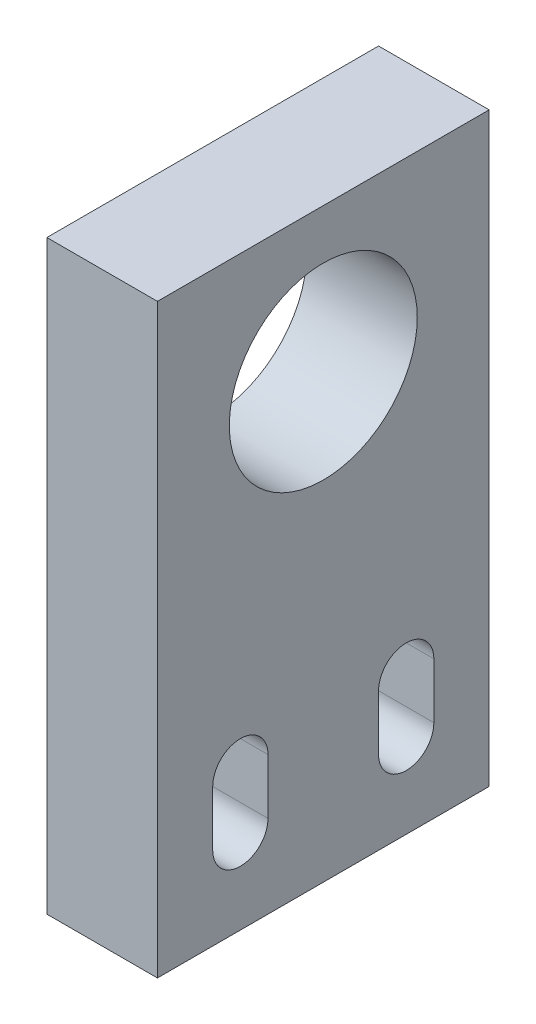
ISO-10303-21;
HEADER;
FILE_DESCRIPTION(('STEP AP214'),'2;1');
FILE_NAME('part.step','',(''),(''),'','','');
FILE_SCHEMA(('AUTOMOTIVE_DESIGN { 1 0 10303 214 1 1 1 1 }'));
ENDSEC;
DATA;
#1=APPLICATION_CONTEXT('core data for automotive mechanical design processes');
#2=APPLICATION_PROTOCOL_DEFINITION('international standard','automotive_design',2000,#1);
#3=PRODUCT_CONTEXT('',#1,'mechanical');
#4=PRODUCT('Part','Part','',(#3));
#5=PRODUCT_RELATED_PRODUCT_CATEGORY('part','',(#4));
#6=PRODUCT_DEFINITION_FORMATION('','',#4);
#7=PRODUCT_DEFINITION_CONTEXT('part definition',#1,'design');
#8=PRODUCT_DEFINITION('design','',#6,#7);
#9=PRODUCT_DEFINITION_SHAPE('','',#8);
#10=(LENGTH_UNIT() NAMED_UNIT(*) SI_UNIT(.MILLI.,.METRE.));
#11=(NAMED_UNIT(*) PLANE_ANGLE_UNIT() SI_UNIT($,.RADIAN.));
#12=(NAMED_UNIT(*) SI_UNIT($,.STERADIAN.) SOLID_ANGLE_UNIT());
#13=UNCERTAINTY_MEASURE_WITH_UNIT(LENGTH_MEASURE(1.E-05),#10,'distance_accuracy_value','');
#14=(GEOMETRIC_REPRESENTATION_CONTEXT(3) GLOBAL_UNCERTAINTY_ASSIGNED_CONTEXT((#13)) GLOBAL_UNIT_ASSIGNED_CONTEXT((#10,
#11,#12)) REPRESENTATION_CONTEXT('',''));
#15=CARTESIAN_POINT('',(0.,0.,0.));
#16=DIRECTION('',(0.,0.,1.));
#17=DIRECTION('',(1.,0.,0.));
#18=AXIS2_PLACEMENT_3D('',#15,#16,#17);
#19=CARTESIAN_POINT('',(10.,0.,0.));
#20=DIRECTION('',(-1.,0.,0.));
#21=DIRECTION('',(0.,0.,1.));
#22=AXIS2_PLACEMENT_3D('',#19,#20,#21);
#23=PLANE('',#22);
#24=CARTESIAN_POINT('',(10.,-27.5,7.49999999999999));
#25=DIRECTION('',(1.,0.,0.));
#26=DIRECTION('',(0.,0.,-1.));
#27=AXIS2_PLACEMENT_3D('',#24,#25,#26);
#28=CIRCLE('',#27,2.50000000000001);
#29=CARTESIAN_POINT('',(10.,-27.5,4.99999999999997));
#30=VERTEX_POINT('',#29);
#31=CARTESIAN_POINT('',(10.,-27.5,9.99999999999999));
#32=VERTEX_POINT('',#31);
#33=EDGE_CURVE('E159',#30,#32,#28,.T.);
#34=ORIENTED_EDGE('',*,*,#33,.F.);
#35=DIRECTION('',(0.,1.,0.));
#36=VECTOR('',#35,1.);
#37=CARTESIAN_POINT('',(10.,-27.5,4.99999999999997));
#38=LINE('',#37,#36);
#39=CARTESIAN_POINT('',(10.,-32.5,4.99999999999997));
#40=VERTEX_POINT('',#39);
#41=EDGE_CURVE('E167',#40,#30,#38,.T.);
#42=ORIENTED_EDGE('',*,*,#41,.F.);
#43=CARTESIAN_POINT('',(10.,-32.5,7.49999999999999));
#44=DIRECTION('',(1.,0.,0.));
#45=DIRECTION('',(0.,0.,-1.));
#46=AXIS2_PLACEMENT_3D('',#43,#44,#45);
#47=CIRCLE('',#46,2.50000000000001);
#48=CARTESIAN_POINT('',(10.,-32.5,10.));
#49=VERTEX_POINT('',#48);
#50=EDGE_CURVE('E164',#49,#40,#47,.T.);
#51=ORIENTED_EDGE('',*,*,#50,.F.);
#52=DIRECTION('',(0.,-1.,0.));
#53=VECTOR('',#52,1.);
#54=CARTESIAN_POINT('',(10.,-27.5,9.99999999999999));
#55=LINE('',#54,#53);
#56=EDGE_CURVE('E161',#32,#49,#55,.T.);
#57=ORIENTED_EDGE('',*,*,#56,.F.);
#58=EDGE_LOOP('',(#34,#42,#51,#57));
#59=FACE_BOUND('',#58,.T.);
#60=DIRECTION('',(0.,-1.,0.));
#61=VECTOR('',#60,1.);
#62=CARTESIAN_POINT('',(10.,-40.,15.));
#63=LINE('',#62,#61);
#64=CARTESIAN_POINT('',(10.,13.,15.));
#65=VERTEX_POINT('',#64);
#66=CARTESIAN_POINT('',(10.,-40.,15.));
#67=VERTEX_POINT('',#66);
#68=EDGE_CURVE('E196',#65,#67,#63,.T.);
#69=ORIENTED_EDGE('',*,*,#68,.T.);
#70=DIRECTION('',(0.,0.,-1.));
#71=VECTOR('',#70,1.);
#72=CARTESIAN_POINT('',(10.,-40.,-15.));
#73=LINE('',#72,#71);
#74=CARTESIAN_POINT('',(10.,-40.,-15.));
#75=VERTEX_POINT('',#74);
#76=EDGE_CURVE('E199',#67,#75,#73,.T.);
#77=ORIENTED_EDGE('',*,*,#76,.T.);
#78=DIRECTION('',(0.,1.,0.));
#79=VECTOR('',#78,1.);
#80=CARTESIAN_POINT('',(10.,13.,-15.));
#81=LINE('',#80,#79);
#82=CARTESIAN_POINT('',(10.,13.,-15.));
#83=VERTEX_POINT('',#82);
#84=EDGE_CURVE('E202',#75,#83,#81,.T.);
#85=ORIENTED_EDGE('',*,*,#84,.T.);
#86=DIRECTION('',(0.,0.,1.));
#87=VECTOR('',#86,1.);
#88=CARTESIAN_POINT('',(10.,13.,15.));
#89=LINE('',#88,#87);
#90=EDGE_CURVE('E204',#83,#65,#89,.T.);
#91=ORIENTED_EDGE('',*,*,#90,.T.);
#92=EDGE_LOOP('',(#69,#77,#85,#91));
#93=FACE_BOUND('',#92,.T.);
#94=CARTESIAN_POINT('',(10.,0.,0.));
#95=DIRECTION('',(1.,0.,0.));
#96=DIRECTION('',(0.,0.,-1.));
#97=AXIS2_PLACEMENT_3D('',#94,#95,#96);
#98=CIRCLE('',#97,8.5);
#99=CARTESIAN_POINT('',(10.,0.,-8.5));
#100=VERTEX_POINT('',#99);
#101=EDGE_CURVE('E190',#100,#100,#98,.T.);
#102=ORIENTED_EDGE('',*,*,#101,.F.);
#103=EDGE_LOOP('',(#102));
#104=FACE_BOUND('',#103,.T.);
#105=CARTESIAN_POINT('',(10.,-27.5,-7.49999999999999));
#106=DIRECTION('',(1.,0.,0.));
#107=DIRECTION('',(0.,0.,1.));
#108=AXIS2_PLACEMENT_3D('',#105,#106,#107);
#109=CIRCLE('',#108,2.50000000000001);
#110=CARTESIAN_POINT('',(10.,-27.5,-10.));
#111=VERTEX_POINT('',#110);
#112=CARTESIAN_POINT('',(10.,-27.5,-4.99999999999998));
#113=VERTEX_POINT('',#112);
#114=EDGE_CURVE('E123',#111,#113,#109,.T.);
#115=ORIENTED_EDGE('',*,*,#114,.F.);
#116=DIRECTION('',(0.,1.,0.));
#117=VECTOR('',#116,1.);
#118=CARTESIAN_POINT('',(10.,-27.5,-10.));
#119=LINE('',#118,#117);
#120=CARTESIAN_POINT('',(10.,-32.5,-10.));
#121=VERTEX_POINT('',#120);
#122=EDGE_CURVE('E145',#121,#111,#119,.T.);
#123=ORIENTED_EDGE('',*,*,#122,.F.);
#124=CARTESIAN_POINT('',(10.,-32.5,-7.49999999999999));
#125=DIRECTION('',(1.,0.,0.));
#126=DIRECTION('',(0.,0.,1.));
#127=AXIS2_PLACEMENT_3D('',#124,#125,#126);
#128=CIRCLE('',#127,2.50000000000001);
#129=CARTESIAN_POINT('',(10.,-32.5,-4.99999999999998));
#130=VERTEX_POINT('',#129);
#131=EDGE_CURVE('E143',#130,#121,#128,.T.);
#132=ORIENTED_EDGE('',*,*,#131,.F.);
#133=DIRECTION('',(0.,-1.,0.));
#134=VECTOR('',#133,1.);
#135=CARTESIAN_POINT('',(10.,-27.5,-4.99999999999998));
#136=LINE('',#135,#134);
#137=EDGE_CURVE('E131',#113,#130,#136,.T.);
#138=ORIENTED_EDGE('',*,*,#137,.F.);
#139=EDGE_LOOP('',(#115,#123,#132,#138));
#140=FACE_BOUND('',#139,.T.);
#141=ADVANCED_FACE('F34',(#59,#93,#104,#140),#23,.F.);
#142=CARTESIAN_POINT('',(0.,0.,0.));
#143=DIRECTION('',(-1.,0.,0.));
#144=DIRECTION('',(0.,0.,1.));
#145=AXIS2_PLACEMENT_3D('',#142,#143,#144);
#146=PLANE('',#145);
#147=DIRECTION('',(0.,-1.,0.));
#148=VECTOR('',#147,1.);
#149=CARTESIAN_POINT('',(0.,-40.,15.));
#150=LINE('',#149,#148);
#151=CARTESIAN_POINT('',(0.,13.,15.));
#152=VERTEX_POINT('',#151);
#153=CARTESIAN_POINT('',(0.,-40.,15.));
#154=VERTEX_POINT('',#153);
#155=EDGE_CURVE('E193',#152,#154,#150,.T.);
#156=ORIENTED_EDGE('',*,*,#155,.F.);
#157=DIRECTION('',(0.,0.,1.));
#158=VECTOR('',#157,1.);
#159=CARTESIAN_POINT('',(0.,13.,15.));
#160=LINE('',#159,#158);
#161=CARTESIAN_POINT('',(0.,13.,-15.));
#162=VERTEX_POINT('',#161);
#163=EDGE_CURVE('E200',#162,#152,#160,.T.);
#164=ORIENTED_EDGE('',*,*,#163,.F.);
#165=DIRECTION('',(0.,1.,0.));
#166=VECTOR('',#165,1.);
#167=CARTESIAN_POINT('',(0.,13.,-15.));
#168=LINE('',#167,#166);
#169=CARTESIAN_POINT('',(0.,-40.,-15.));
#170=VERTEX_POINT('',#169);
#171=EDGE_CURVE('E211',#170,#162,#168,.T.);
#172=ORIENTED_EDGE('',*,*,#171,.F.);
#173=DIRECTION('',(0.,0.,-1.));
#174=VECTOR('',#173,1.);
#175=CARTESIAN_POINT('',(0.,-40.,-15.));
#176=LINE('',#175,#174);
#177=EDGE_CURVE('E209',#154,#170,#176,.T.);
#178=ORIENTED_EDGE('',*,*,#177,.F.);
#179=EDGE_LOOP('',(#156,#164,#172,#178));
#180=FACE_BOUND('',#179,.T.);
#181=CARTESIAN_POINT('',(0.,0.,0.));
#182=DIRECTION('',(1.,0.,0.));
#183=DIRECTION('',(0.,0.,-1.));
#184=AXIS2_PLACEMENT_3D('',#181,#182,#183);
#185=CIRCLE('',#184,8.5);
#186=CARTESIAN_POINT('',(0.,0.,-8.5));
#187=VERTEX_POINT('',#186);
#188=EDGE_CURVE('E189',#187,#187,#185,.T.);
#189=ORIENTED_EDGE('',*,*,#188,.T.);
#190=EDGE_LOOP('',(#189));
#191=FACE_BOUND('',#190,.T.);
#192=DIRECTION('',(0.,1.,0.));
#193=VECTOR('',#192,1.);
#194=CARTESIAN_POINT('',(0.,-27.5,4.99999999999997));
#195=LINE('',#194,#193);
#196=CARTESIAN_POINT('',(0.,-32.5,4.99999999999997));
#197=VERTEX_POINT('',#196);
#198=CARTESIAN_POINT('',(0.,-27.5,4.99999999999997));
#199=VERTEX_POINT('',#198);
#200=EDGE_CURVE('E162',#197,#199,#195,.T.);
#201=ORIENTED_EDGE('',*,*,#200,.T.);
#202=CARTESIAN_POINT('',(0.,-27.5,7.49999999999999));
#203=DIRECTION('',(1.,0.,0.));
#204=DIRECTION('',(0.,0.,-1.));
#205=AXIS2_PLACEMENT_3D('',#202,#203,#204);
#206=CIRCLE('',#205,2.50000000000001);
#207=CARTESIAN_POINT('',(0.,-27.5,9.99999999999999));
#208=VERTEX_POINT('',#207);
#209=EDGE_CURVE('E139',#199,#208,#206,.T.);
#210=ORIENTED_EDGE('',*,*,#209,.T.);
#211=DIRECTION('',(0.,-1.,0.));
#212=VECTOR('',#211,1.);
#213=CARTESIAN_POINT('',(0.,-27.5,9.99999999999999));
#214=LINE('',#213,#212);
#215=CARTESIAN_POINT('',(0.,-32.5,10.));
#216=VERTEX_POINT('',#215);
#217=EDGE_CURVE('E172',#208,#216,#214,.T.);
#218=ORIENTED_EDGE('',*,*,#217,.T.);
#219=CARTESIAN_POINT('',(0.,-32.5,7.49999999999999));
#220=DIRECTION('',(1.,0.,0.));
#221=DIRECTION('',(0.,0.,-1.));
#222=AXIS2_PLACEMENT_3D('',#219,#220,#221);
#223=CIRCLE('',#222,2.50000000000001);
#224=EDGE_CURVE('E175',#216,#197,#223,.T.);
#225=ORIENTED_EDGE('',*,*,#224,.T.);
#226=EDGE_LOOP('',(#201,#210,#218,#225));
#227=FACE_BOUND('',#226,.T.);
#228=DIRECTION('',(0.,1.,0.));
#229=VECTOR('',#228,1.);
#230=CARTESIAN_POINT('',(0.,-27.5,-10.));
#231=LINE('',#230,#229);
#232=CARTESIAN_POINT('',(0.,-32.5,-10.));
#233=VERTEX_POINT('',#232);
#234=CARTESIAN_POINT('',(0.,-27.5,-10.));
#235=VERTEX_POINT('',#234);
#236=EDGE_CURVE('E132',#233,#235,#231,.T.);
#237=ORIENTED_EDGE('',*,*,#236,.T.);
#238=CARTESIAN_POINT('',(0.,-27.5,-7.49999999999999));
#239=DIRECTION('',(1.,0.,0.));
#240=DIRECTION('',(0.,0.,1.));
#241=AXIS2_PLACEMENT_3D('',#238,#239,#240);
#242=CIRCLE('',#241,2.50000000000001);
#243=CARTESIAN_POINT('',(0.,-27.5,-4.99999999999998));
#244=VERTEX_POINT('',#243);
#245=EDGE_CURVE('E57',#235,#244,#242,.T.);
#246=ORIENTED_EDGE('',*,*,#245,.T.);
#247=DIRECTION('',(0.,-1.,0.));
#248=VECTOR('',#247,1.);
#249=CARTESIAN_POINT('',(0.,-27.5,-4.99999999999998));
#250=LINE('',#249,#248);
#251=CARTESIAN_POINT('',(0.,-32.5,-4.99999999999998));
#252=VERTEX_POINT('',#251);
#253=EDGE_CURVE('E138',#244,#252,#250,.T.);
#254=ORIENTED_EDGE('',*,*,#253,.T.);
#255=CARTESIAN_POINT('',(0.,-32.5,-7.49999999999999));
#256=DIRECTION('',(1.,0.,0.));
#257=DIRECTION('',(0.,0.,1.));
#258=AXIS2_PLACEMENT_3D('',#255,#256,#257);
#259=CIRCLE('',#258,2.50000000000001);
#260=EDGE_CURVE('E151',#252,#233,#259,.T.);
#261=ORIENTED_EDGE('',*,*,#260,.T.);
#262=EDGE_LOOP('',(#237,#246,#254,#261));
#263=FACE_BOUND('',#262,.T.);
#264=ADVANCED_FACE('F229',(#180,#191,#227,#263),#146,.T.);
#265=CARTESIAN_POINT('',(10.,-40.,15.));
#266=DIRECTION('',(0.,0.,-1.));
#267=DIRECTION('',(-1.,0.,0.));
#268=AXIS2_PLACEMENT_3D('',#265,#266,#267);
#269=PLANE('',#268);
#270=ORIENTED_EDGE('',*,*,#155,.T.);
#271=DIRECTION('',(-1.,0.,0.));
#272=VECTOR('',#271,1.);
#273=CARTESIAN_POINT('',(10.,-40.,15.));
#274=LINE('',#273,#272);
#275=EDGE_CURVE('E11',#67,#154,#274,.T.);
#276=ORIENTED_EDGE('',*,*,#275,.F.);
#277=ORIENTED_EDGE('',*,*,#68,.F.);
#278=DIRECTION('',(-1.,0.,0.));
#279=VECTOR('',#278,1.);
#280=CARTESIAN_POINT('',(10.,13.,15.));
#281=LINE('',#280,#279);
#282=EDGE_CURVE('E206',#65,#152,#281,.T.);
#283=ORIENTED_EDGE('',*,*,#282,.T.);
#284=EDGE_LOOP('',(#270,#276,#277,#283));
#285=FACE_BOUND('',#284,.T.);
#286=ADVANCED_FACE('F36',(#285),#269,.F.);
#287=CARTESIAN_POINT('',(10.,-40.,-15.));
#288=DIRECTION('',(0.,1.,0.));
#289=DIRECTION('',(0.,0.,1.));
#290=AXIS2_PLACEMENT_3D('',#287,#288,#289);
#291=PLANE('',#290);
#292=ORIENTED_EDGE('',*,*,#177,.T.);
#293=DIRECTION('',(-1.,0.,0.));
#294=VECTOR('',#293,1.);
#295=CARTESIAN_POINT('',(10.,-40.,-15.));
#296=LINE('',#295,#294);
#297=EDGE_CURVE('E42',#75,#170,#296,.T.);
#298=ORIENTED_EDGE('',*,*,#297,.F.);
#299=ORIENTED_EDGE('',*,*,#76,.F.);
#300=ORIENTED_EDGE('',*,*,#275,.T.);
#301=EDGE_LOOP('',(#292,#298,#299,#300));
#302=FACE_BOUND('',#301,.T.);
#303=ADVANCED_FACE('F240',(#302),#291,.F.);
#304=CARTESIAN_POINT('',(10.,13.,-15.));
#305=DIRECTION('',(0.,0.,1.));
#306=DIRECTION('',(0.,-1.,0.));
#307=AXIS2_PLACEMENT_3D('',#304,#305,#306);
#308=PLANE('',#307);
#309=ORIENTED_EDGE('',*,*,#171,.T.);
#310=DIRECTION('',(-1.,0.,0.));
#311=VECTOR('',#310,1.);
#312=CARTESIAN_POINT('',(10.,13.,-15.));
#313=LINE('',#312,#311);
#314=EDGE_CURVE('E216',#83,#162,#313,.T.);
#315=ORIENTED_EDGE('',*,*,#314,.F.);
#316=ORIENTED_EDGE('',*,*,#84,.F.);
#317=ORIENTED_EDGE('',*,*,#297,.T.);
#318=EDGE_LOOP('',(#309,#315,#316,#317));
#319=FACE_BOUND('',#318,.T.);
#320=ADVANCED_FACE('F223',(#319),#308,.F.);
#321=CARTESIAN_POINT('',(10.,13.,15.));
#322=DIRECTION('',(0.,-1.,0.));
#323=DIRECTION('',(0.,0.,-1.));
#324=AXIS2_PLACEMENT_3D('',#321,#322,#323);
#325=PLANE('',#324);
#326=ORIENTED_EDGE('',*,*,#163,.T.);
#327=ORIENTED_EDGE('',*,*,#282,.F.);
#328=ORIENTED_EDGE('',*,*,#90,.F.);
#329=ORIENTED_EDGE('',*,*,#314,.T.);
#330=EDGE_LOOP('',(#326,#327,#328,#329));
#331=FACE_BOUND('',#330,.T.);
#332=ADVANCED_FACE('F233',(#331),#325,.F.);
#333=CARTESIAN_POINT('',(10.,0.,0.));
#334=DIRECTION('',(-1.,0.,0.));
#335=DIRECTION('',(0.,0.,1.));
#336=AXIS2_PLACEMENT_3D('',#333,#334,#335);
#337=CYLINDRICAL_SURFACE('',#336,8.5);
#338=ORIENTED_EDGE('',*,*,#101,.T.);
#339=EDGE_LOOP('',(#338));
#340=FACE_BOUND('',#339,.T.);
#341=ORIENTED_EDGE('',*,*,#188,.F.);
#342=EDGE_LOOP('',(#341));
#343=FACE_BOUND('',#342,.T.);
#344=ADVANCED_FACE('F256',(#340,#343),#337,.F.);
#345=CARTESIAN_POINT('',(10.,-27.5,7.49999999999999));
#346=DIRECTION('',(-1.,0.,0.));
#347=DIRECTION('',(0.,0.,1.));
#348=AXIS2_PLACEMENT_3D('',#345,#346,#347);
#349=CYLINDRICAL_SURFACE('',#348,2.50000000000001);
#350=ORIENTED_EDGE('',*,*,#209,.F.);
#351=DIRECTION('',(-1.,0.,0.));
#352=VECTOR('',#351,1.);
#353=CARTESIAN_POINT('',(10.,-27.5,4.99999999999997));
#354=LINE('',#353,#352);
#355=EDGE_CURVE('E169',#30,#199,#354,.T.);
#356=ORIENTED_EDGE('',*,*,#355,.F.);
#357=ORIENTED_EDGE('',*,*,#33,.T.);
#358=DIRECTION('',(-1.,0.,0.));
#359=VECTOR('',#358,1.);
#360=CARTESIAN_POINT('',(10.,-27.5,9.99999999999999));
#361=LINE('',#360,#359);
#362=EDGE_CURVE('E186',#32,#208,#361,.T.);
#363=ORIENTED_EDGE('',*,*,#362,.T.);
#364=EDGE_LOOP('',(#350,#356,#357,#363));
#365=FACE_BOUND('',#364,.T.);
#366=ADVANCED_FACE('F263',(#365),#349,.F.);
#367=CARTESIAN_POINT('',(10.,-27.5,9.99999999999999));
#368=DIRECTION('',(0.,0.,-1.));
#369=DIRECTION('',(-1.,0.,0.));
#370=AXIS2_PLACEMENT_3D('',#367,#368,#369);
#371=PLANE('',#370);
#372=ORIENTED_EDGE('',*,*,#217,.F.);
#373=ORIENTED_EDGE('',*,*,#362,.F.);
#374=ORIENTED_EDGE('',*,*,#56,.T.);
#375=DIRECTION('',(-1.,0.,0.));
#376=VECTOR('',#375,1.);
#377=CARTESIAN_POINT('',(10.,-32.5,10.));
#378=LINE('',#377,#376);
#379=EDGE_CURVE('E184',#49,#216,#378,.T.);
#380=ORIENTED_EDGE('',*,*,#379,.T.);
#381=EDGE_LOOP('',(#372,#373,#374,#380));
#382=FACE_BOUND('',#381,.T.);
#383=ADVANCED_FACE('F268',(#382),#371,.T.);
#384=CARTESIAN_POINT('',(10.,-32.5,7.49999999999999));
#385=DIRECTION('',(-1.,0.,0.));
#386=DIRECTION('',(0.,0.,1.));
#387=AXIS2_PLACEMENT_3D('',#384,#385,#386);
#388=CYLINDRICAL_SURFACE('',#387,2.50000000000001);
#389=ORIENTED_EDGE('',*,*,#224,.F.);
#390=ORIENTED_EDGE('',*,*,#379,.F.);
#391=ORIENTED_EDGE('',*,*,#50,.T.);
#392=DIRECTION('',(-1.,0.,0.));
#393=VECTOR('',#392,1.);
#394=CARTESIAN_POINT('',(10.,-32.5,4.99999999999997));
#395=LINE('',#394,#393);
#396=EDGE_CURVE('E182',#40,#197,#395,.T.);
#397=ORIENTED_EDGE('',*,*,#396,.T.);
#398=EDGE_LOOP('',(#389,#390,#391,#397));
#399=FACE_BOUND('',#398,.T.);
#400=ADVANCED_FACE('F294',(#399),#388,.F.);
#401=CARTESIAN_POINT('',(10.,-27.5,4.99999999999997));
#402=DIRECTION('',(0.,0.,1.));
#403=DIRECTION('',(1.,0.,0.));
#404=AXIS2_PLACEMENT_3D('',#401,#402,#403);
#405=PLANE('',#404);
#406=ORIENTED_EDGE('',*,*,#200,.F.);
#407=ORIENTED_EDGE('',*,*,#396,.F.);
#408=ORIENTED_EDGE('',*,*,#41,.T.);
#409=ORIENTED_EDGE('',*,*,#355,.T.);
#410=EDGE_LOOP('',(#406,#407,#408,#409));
#411=FACE_BOUND('',#410,.T.);
#412=ADVANCED_FACE('F291',(#411),#405,.T.);
#413=CARTESIAN_POINT('',(10.,-27.5,-7.49999999999999));
#414=DIRECTION('',(-1.,0.,0.));
#415=DIRECTION('',(0.,0.,1.));
#416=AXIS2_PLACEMENT_3D('',#413,#414,#415);
#417=CYLINDRICAL_SURFACE('',#416,2.50000000000001);
#418=ORIENTED_EDGE('',*,*,#245,.F.);
#419=DIRECTION('',(-1.,0.,0.));
#420=VECTOR('',#419,1.);
#421=CARTESIAN_POINT('',(10.,-27.5,-10.));
#422=LINE('',#421,#420);
#423=EDGE_CURVE('E127',#111,#235,#422,.T.);
#424=ORIENTED_EDGE('',*,*,#423,.F.);
#425=ORIENTED_EDGE('',*,*,#114,.T.);
#426=DIRECTION('',(-1.,0.,0.));
#427=VECTOR('',#426,1.);
#428=CARTESIAN_POINT('',(10.,-27.5,-4.99999999999998));
#429=LINE('',#428,#427);
#430=EDGE_CURVE('E126',#113,#244,#429,.T.);
#431=ORIENTED_EDGE('',*,*,#430,.T.);
#432=EDGE_LOOP('',(#418,#424,#425,#431));
#433=FACE_BOUND('',#432,.T.);
#434=ADVANCED_FACE('F125',(#433),#417,.F.);
#435=CARTESIAN_POINT('',(10.,-27.5,-4.99999999999998));
#436=DIRECTION('',(0.,0.,-1.));
#437=DIRECTION('',(-1.,0.,0.));
#438=AXIS2_PLACEMENT_3D('',#435,#436,#437);
#439=PLANE('',#438);
#440=ORIENTED_EDGE('',*,*,#253,.F.);
#441=ORIENTED_EDGE('',*,*,#430,.F.);
#442=ORIENTED_EDGE('',*,*,#137,.T.);
#443=DIRECTION('',(-1.,0.,0.));
#444=VECTOR('',#443,1.);
#445=CARTESIAN_POINT('',(10.,-32.5,-4.99999999999998));
#446=LINE('',#445,#444);
#447=EDGE_CURVE('E140',#130,#252,#446,.T.);
#448=ORIENTED_EDGE('',*,*,#447,.T.);
#449=EDGE_LOOP('',(#440,#441,#442,#448));
#450=FACE_BOUND('',#449,.T.);
#451=ADVANCED_FACE('F135',(#450),#439,.T.);
#452=CARTESIAN_POINT('',(10.,-32.5,-7.49999999999999));
#453=DIRECTION('',(-1.,0.,0.));
#454=DIRECTION('',(0.,0.,1.));
#455=AXIS2_PLACEMENT_3D('',#452,#453,#454);
#456=CYLINDRICAL_SURFACE('',#455,2.50000000000001);
#457=ORIENTED_EDGE('',*,*,#260,.F.);
#458=ORIENTED_EDGE('',*,*,#447,.F.);
#459=ORIENTED_EDGE('',*,*,#131,.T.);
#460=DIRECTION('',(-1.,0.,0.));
#461=VECTOR('',#460,1.);
#462=CARTESIAN_POINT('',(10.,-32.5,-10.));
#463=LINE('',#462,#461);
#464=EDGE_CURVE('E49',#121,#233,#463,.T.);
#465=ORIENTED_EDGE('',*,*,#464,.T.);
#466=EDGE_LOOP('',(#457,#458,#459,#465));
#467=FACE_BOUND('',#466,.T.);
#468=ADVANCED_FACE('F279',(#467),#456,.F.);
#469=CARTESIAN_POINT('',(10.,-27.5,-10.));
#470=DIRECTION('',(0.,0.,1.));
#471=DIRECTION('',(1.,0.,0.));
#472=AXIS2_PLACEMENT_3D('',#469,#470,#471);
#473=PLANE('',#472);
#474=ORIENTED_EDGE('',*,*,#236,.F.);
#475=ORIENTED_EDGE('',*,*,#464,.F.);
#476=ORIENTED_EDGE('',*,*,#122,.T.);
#477=ORIENTED_EDGE('',*,*,#423,.T.);
#478=EDGE_LOOP('',(#474,#475,#476,#477));
#479=FACE_BOUND('',#478,.T.);
#480=ADVANCED_FACE('F277',(#479),#473,.T.);
#481=CLOSED_SHELL('',(#141,#264,#286,#303,#320,#332,#344,#366,#383,#400,#412,#434,#451,#468,#480));
#482=MANIFOLD_SOLID_BREP('B2',#481);
#483=ADVANCED_BREP_SHAPE_REPRESENTATION('',(#18,#482),#14);
#484=SHAPE_DEFINITION_REPRESENTATION(#9,#483);
ENDSEC;
END-ISO-10303-21;
